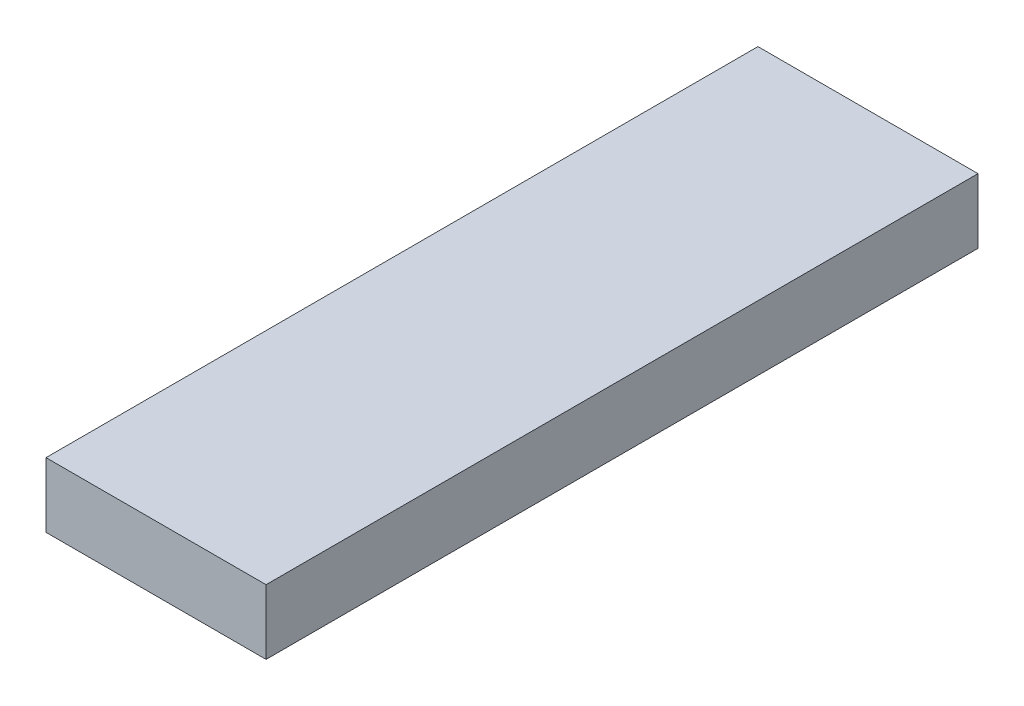
ISO-10303-21;
HEADER;
FILE_DESCRIPTION(('STEP AP214'),'2;1');
FILE_NAME('part.step','',(''),(''),'','','');
FILE_SCHEMA(('AUTOMOTIVE_DESIGN { 1 0 10303 214 1 1 1 1 }'));
ENDSEC;
DATA;
#1=APPLICATION_CONTEXT('core data for automotive mechanical design processes');
#2=APPLICATION_PROTOCOL_DEFINITION('international standard','automotive_design',2000,#1);
#3=PRODUCT_CONTEXT('',#1,'mechanical');
#4=PRODUCT('Part','Part','',(#3));
#5=PRODUCT_RELATED_PRODUCT_CATEGORY('part','',(#4));
#6=PRODUCT_DEFINITION_FORMATION('','',#4);
#7=PRODUCT_DEFINITION_CONTEXT('part definition',#1,'design');
#8=PRODUCT_DEFINITION('design','',#6,#7);
#9=PRODUCT_DEFINITION_SHAPE('','',#8);
#10=(LENGTH_UNIT() NAMED_UNIT(*) SI_UNIT(.MILLI.,.METRE.));
#11=(NAMED_UNIT(*) PLANE_ANGLE_UNIT() SI_UNIT($,.RADIAN.));
#12=(NAMED_UNIT(*) SI_UNIT($,.STERADIAN.) SOLID_ANGLE_UNIT());
#13=UNCERTAINTY_MEASURE_WITH_UNIT(LENGTH_MEASURE(1.E-05),#10,'distance_accuracy_value','');
#14=(GEOMETRIC_REPRESENTATION_CONTEXT(3) GLOBAL_UNCERTAINTY_ASSIGNED_CONTEXT((#13)) GLOBAL_UNIT_ASSIGNED_CONTEXT((#10,
#11,#12)) REPRESENTATION_CONTEXT('',''));
#15=CARTESIAN_POINT('',(0.,0.,0.));
#16=DIRECTION('',(0.,0.,1.));
#17=DIRECTION('',(1.,0.,0.));
#18=AXIS2_PLACEMENT_3D('',#15,#16,#17);
#19=CARTESIAN_POINT('',(-4.6,10.,-4.43262956981357));
#20=DIRECTION('',(1.,0.,0.));
#21=DIRECTION('',(0.,0.,-1.));
#22=AXIS2_PLACEMENT_3D('',#19,#20,#21);
#23=PLANE('',#22);
#24=DIRECTION('',(0.,0.,1.));
#25=VECTOR('',#24,1.);
#26=CARTESIAN_POINT('',(-4.6,0.,-4.43262956981357));
#27=LINE('',#26,#25);
#28=CARTESIAN_POINT('',(-4.6,0.,-4.43262956981357));
#29=VERTEX_POINT('',#28);
#30=CARTESIAN_POINT('',(-4.6,0.,105.567370430186));
#31=VERTEX_POINT('',#30);
#32=EDGE_CURVE('E86',#29,#31,#27,.T.);
#33=ORIENTED_EDGE('',*,*,#32,.T.);
#34=DIRECTION('',(0.,-1.,0.));
#35=VECTOR('',#34,1.);
#36=CARTESIAN_POINT('',(-4.6,10.,105.567370430186));
#37=LINE('',#36,#35);
#38=CARTESIAN_POINT('',(-4.6,10.,105.567370430186));
#39=VERTEX_POINT('',#38);
#40=EDGE_CURVE('E89',#39,#31,#37,.T.);
#41=ORIENTED_EDGE('',*,*,#40,.F.);
#42=DIRECTION('',(0.,0.,1.));
#43=VECTOR('',#42,1.);
#44=CARTESIAN_POINT('',(-4.6,10.,-4.43262956981357));
#45=LINE('',#44,#43);
#46=CARTESIAN_POINT('',(-4.6,10.,-4.43262956981357));
#47=VERTEX_POINT('',#46);
#48=EDGE_CURVE('E74',#47,#39,#45,.T.);
#49=ORIENTED_EDGE('',*,*,#48,.F.);
#50=DIRECTION('',(0.,-1.,0.));
#51=VECTOR('',#50,1.);
#52=CARTESIAN_POINT('',(-4.6,10.,-4.43262956981357));
#53=LINE('',#52,#51);
#54=EDGE_CURVE('E49',#47,#29,#53,.T.);
#55=ORIENTED_EDGE('',*,*,#54,.T.);
#56=EDGE_LOOP('',(#33,#41,#49,#55));
#57=FACE_BOUND('',#56,.T.);
#58=ADVANCED_FACE('F41',(#57),#23,.F.);
#59=CARTESIAN_POINT('',(29.4,10.,-4.43262956981357));
#60=DIRECTION('',(-1.,0.,0.));
#61=DIRECTION('',(0.,0.,1.));
#62=AXIS2_PLACEMENT_3D('',#59,#60,#61);
#63=PLANE('',#62);
#64=DIRECTION('',(0.,0.,-1.));
#65=VECTOR('',#64,1.);
#66=CARTESIAN_POINT('',(29.4,0.,-4.43262956981357));
#67=LINE('',#66,#65);
#68=CARTESIAN_POINT('',(29.4,0.,105.567370430186));
#69=VERTEX_POINT('',#68);
#70=CARTESIAN_POINT('',(29.4,0.,-4.43262956981357));
#71=VERTEX_POINT('',#70);
#72=EDGE_CURVE('E68',#69,#71,#67,.T.);
#73=ORIENTED_EDGE('',*,*,#72,.T.);
#74=DIRECTION('',(0.,-1.,0.));
#75=VECTOR('',#74,1.);
#76=CARTESIAN_POINT('',(29.4,10.,-4.43262956981357));
#77=LINE('',#76,#75);
#78=CARTESIAN_POINT('',(29.4,10.,-4.43262956981357));
#79=VERTEX_POINT('',#78);
#80=EDGE_CURVE('E11',#79,#71,#77,.T.);
#81=ORIENTED_EDGE('',*,*,#80,.F.);
#82=DIRECTION('',(0.,0.,-1.));
#83=VECTOR('',#82,1.);
#84=CARTESIAN_POINT('',(29.4,10.,-4.43262956981357));
#85=LINE('',#84,#83);
#86=CARTESIAN_POINT('',(29.4,10.,105.567370430186));
#87=VERTEX_POINT('',#86);
#88=EDGE_CURVE('E133',#87,#79,#85,.T.);
#89=ORIENTED_EDGE('',*,*,#88,.F.);
#90=DIRECTION('',(0.,-1.,0.));
#91=VECTOR('',#90,1.);
#92=CARTESIAN_POINT('',(29.4,10.,105.567370430186));
#93=LINE('',#92,#91);
#94=EDGE_CURVE('E104',#87,#69,#93,.T.);
#95=ORIENTED_EDGE('',*,*,#94,.T.);
#96=EDGE_LOOP('',(#73,#81,#89,#95));
#97=FACE_BOUND('',#96,.T.);
#98=ADVANCED_FACE('F140',(#97),#63,.F.);
#99=CARTESIAN_POINT('',(-4.6,10.,-4.43262956981357));
#100=DIRECTION('',(0.,0.,1.));
#101=DIRECTION('',(1.,0.,0.));
#102=AXIS2_PLACEMENT_3D('',#99,#100,#101);
#103=PLANE('',#102);
#104=DIRECTION('',(-1.,0.,0.));
#105=VECTOR('',#104,1.);
#106=CARTESIAN_POINT('',(-4.6,0.,-4.43262956981357));
#107=LINE('',#106,#105);
#108=EDGE_CURVE('E134',#71,#29,#107,.T.);
#109=ORIENTED_EDGE('',*,*,#108,.T.);
#110=ORIENTED_EDGE('',*,*,#54,.F.);
#111=DIRECTION('',(-1.,0.,0.));
#112=VECTOR('',#111,1.);
#113=CARTESIAN_POINT('',(-4.6,10.,-4.43262956981357));
#114=LINE('',#113,#112);
#115=EDGE_CURVE('E57',#79,#47,#114,.T.);
#116=ORIENTED_EDGE('',*,*,#115,.F.);
#117=ORIENTED_EDGE('',*,*,#80,.T.);
#118=EDGE_LOOP('',(#109,#110,#116,#117));
#119=FACE_BOUND('',#118,.T.);
#120=ADVANCED_FACE('F139',(#119),#103,.F.);
#121=CARTESIAN_POINT('',(0.,10.,0.));
#122=DIRECTION('',(0.,1.,0.));
#123=DIRECTION('',(0.,0.,1.));
#124=AXIS2_PLACEMENT_3D('',#121,#122,#123);
#125=PLANE('',#124);
#126=ORIENTED_EDGE('',*,*,#48,.T.);
#127=DIRECTION('',(-1.,0.,0.));
#128=VECTOR('',#127,1.);
#129=CARTESIAN_POINT('',(-4.6,10.,105.567370430186));
#130=LINE('',#129,#128);
#131=EDGE_CURVE('E100',#87,#39,#130,.T.);
#132=ORIENTED_EDGE('',*,*,#131,.F.);
#133=ORIENTED_EDGE('',*,*,#88,.T.);
#134=ORIENTED_EDGE('',*,*,#115,.T.);
#135=EDGE_LOOP('',(#126,#132,#133,#134));
#136=FACE_BOUND('',#135,.T.);
#137=ADVANCED_FACE('F141',(#136),#125,.T.);
#138=CARTESIAN_POINT('',(0.,0.,0.));
#139=DIRECTION('',(0.,1.,0.));
#140=DIRECTION('',(0.,0.,1.));
#141=AXIS2_PLACEMENT_3D('',#138,#139,#140);
#142=PLANE('',#141);
#143=CARTESIAN_POINT('',(24.8,0.,0.));
#144=DIRECTION('',(0.,1.,0.));
#145=DIRECTION('',(0.,0.,1.));
#146=AXIS2_PLACEMENT_3D('',#143,#144,#145);
#147=CIRCLE('',#146,3.15);
#148=CARTESIAN_POINT('',(24.8,0.,3.15));
#149=VERTEX_POINT('',#148);
#150=EDGE_CURVE('E116',#149,#149,#147,.T.);
#151=ORIENTED_EDGE('',*,*,#150,.T.);
#152=EDGE_LOOP('',(#151));
#153=FACE_BOUND('',#152,.T.);
#154=CARTESIAN_POINT('',(2.58247649578986E-13,0.,24.8));
#155=DIRECTION('',(0.,1.,0.));
#156=DIRECTION('',(0.,0.,1.));
#157=AXIS2_PLACEMENT_3D('',#154,#155,#156);
#158=CIRCLE('',#157,3.15);
#159=CARTESIAN_POINT('',(2.58247649578986E-13,0.,27.95));
#160=VERTEX_POINT('',#159);
#161=EDGE_CURVE('E123',#160,#160,#158,.T.);
#162=ORIENTED_EDGE('',*,*,#161,.T.);
#163=EDGE_LOOP('',(#162));
#164=FACE_BOUND('',#163,.T.);
#165=CARTESIAN_POINT('',(24.8000000000003,0.,24.8));
#166=DIRECTION('',(0.,1.,0.));
#167=DIRECTION('',(0.,0.,1.));
#168=AXIS2_PLACEMENT_3D('',#165,#166,#167);
#169=CIRCLE('',#168,3.15);
#170=CARTESIAN_POINT('',(24.8000000000003,0.,27.95));
#171=VERTEX_POINT('',#170);
#172=EDGE_CURVE('E110',#171,#171,#169,.T.);
#173=ORIENTED_EDGE('',*,*,#172,.T.);
#174=EDGE_LOOP('',(#173));
#175=FACE_BOUND('',#174,.T.);
#176=CARTESIAN_POINT('',(0.,0.,0.));
#177=DIRECTION('',(0.,1.,0.));
#178=DIRECTION('',(0.,0.,1.));
#179=AXIS2_PLACEMENT_3D('',#176,#177,#178);
#180=CIRCLE('',#179,3.15);
#181=CARTESIAN_POINT('',(0.,0.,3.15));
#182=VERTEX_POINT('',#181);
#183=EDGE_CURVE('E119',#182,#182,#180,.T.);
#184=ORIENTED_EDGE('',*,*,#183,.T.);
#185=EDGE_LOOP('',(#184));
#186=FACE_BOUND('',#185,.T.);
#187=ORIENTED_EDGE('',*,*,#32,.F.);
#188=ORIENTED_EDGE('',*,*,#108,.F.);
#189=ORIENTED_EDGE('',*,*,#72,.F.);
#190=DIRECTION('',(-1.,0.,0.));
#191=VECTOR('',#190,1.);
#192=CARTESIAN_POINT('',(-4.6,0.,105.567370430186));
#193=LINE('',#192,#191);
#194=EDGE_CURVE('E95',#69,#31,#193,.T.);
#195=ORIENTED_EDGE('',*,*,#194,.T.);
#196=EDGE_LOOP('',(#187,#188,#189,#195));
#197=FACE_BOUND('',#196,.T.);
#198=CARTESIAN_POINT('',(24.8,0.,101.134740860373));
#199=DIRECTION('',(0.,-1.,0.));
#200=DIRECTION('',(0.,0.,-1.));
#201=AXIS2_PLACEMENT_3D('',#198,#199,#200);
#202=CIRCLE('',#201,3.15);
#203=CARTESIAN_POINT('',(24.8,0.,97.9847408603729));
#204=VERTEX_POINT('',#203);
#205=EDGE_CURVE('E379',#204,#204,#202,.T.);
#206=ORIENTED_EDGE('',*,*,#205,.F.);
#207=EDGE_LOOP('',(#206));
#208=FACE_BOUND('',#207,.T.);
#209=CARTESIAN_POINT('',(2.58247649578986E-13,0.,76.3347408603729));
#210=DIRECTION('',(0.,-1.,0.));
#211=DIRECTION('',(0.,0.,-1.));
#212=AXIS2_PLACEMENT_3D('',#209,#210,#211);
#213=CIRCLE('',#212,3.15);
#214=CARTESIAN_POINT('',(2.58247649578986E-13,0.,73.1847408603729));
#215=VERTEX_POINT('',#214);
#216=EDGE_CURVE('E380',#215,#215,#213,.T.);
#217=ORIENTED_EDGE('',*,*,#216,.F.);
#218=EDGE_LOOP('',(#217));
#219=FACE_BOUND('',#218,.T.);
#220=CARTESIAN_POINT('',(24.8000000000003,0.,76.3347408603729));
#221=DIRECTION('',(0.,-1.,0.));
#222=DIRECTION('',(0.,0.,-1.));
#223=AXIS2_PLACEMENT_3D('',#220,#221,#222);
#224=CIRCLE('',#223,3.15);
#225=CARTESIAN_POINT('',(24.8000000000003,0.,73.1847408603729));
#226=VERTEX_POINT('',#225);
#227=EDGE_CURVE('E392',#226,#226,#224,.T.);
#228=ORIENTED_EDGE('',*,*,#227,.F.);
#229=EDGE_LOOP('',(#228));
#230=FACE_BOUND('',#229,.T.);
#231=CARTESIAN_POINT('',(0.,0.,101.134740860373));
#232=DIRECTION('',(0.,-1.,0.));
#233=DIRECTION('',(0.,0.,-1.));
#234=AXIS2_PLACEMENT_3D('',#231,#232,#233);
#235=CIRCLE('',#234,3.15);
#236=CARTESIAN_POINT('',(0.,0.,97.9847408603729));
#237=VERTEX_POINT('',#236);
#238=EDGE_CURVE('E383',#237,#237,#235,.T.);
#239=ORIENTED_EDGE('',*,*,#238,.F.);
#240=EDGE_LOOP('',(#239));
#241=FACE_BOUND('',#240,.T.);
#242=ADVANCED_FACE('F96',(#153,#164,#175,#186,#197,#208,#219,#230,#241),#142,.F.);
#243=CARTESIAN_POINT('',(0.,5.,0.));
#244=DIRECTION('',(0.,-1.,0.));
#245=DIRECTION('',(0.,0.,-1.));
#246=AXIS2_PLACEMENT_3D('',#243,#244,#245);
#247=CYLINDRICAL_SURFACE('',#246,3.15);
#248=CARTESIAN_POINT('',(0.,5.,0.));
#249=DIRECTION('',(0.,1.,0.));
#250=DIRECTION('',(0.,0.,1.));
#251=AXIS2_PLACEMENT_3D('',#248,#249,#250);
#252=CIRCLE('',#251,3.15);
#253=CARTESIAN_POINT('',(0.,5.,3.15));
#254=VERTEX_POINT('',#253);
#255=EDGE_CURVE('E92',#254,#254,#252,.T.);
#256=ORIENTED_EDGE('',*,*,#255,.T.);
#257=EDGE_LOOP('',(#256));
#258=FACE_BOUND('',#257,.T.);
#259=ORIENTED_EDGE('',*,*,#183,.F.);
#260=EDGE_LOOP('',(#259));
#261=FACE_BOUND('',#260,.T.);
#262=ADVANCED_FACE('F148',(#258,#261),#247,.F.);
#263=CARTESIAN_POINT('',(0.,5.,0.));
#264=DIRECTION('',(0.,1.,0.));
#265=DIRECTION('',(0.,0.,1.));
#266=AXIS2_PLACEMENT_3D('',#263,#264,#265);
#267=PLANE('',#266);
#268=ORIENTED_EDGE('',*,*,#255,.F.);
#269=EDGE_LOOP('',(#268));
#270=FACE_BOUND('',#269,.T.);
#271=ADVANCED_FACE('F278',(#270),#267,.F.);
#272=CARTESIAN_POINT('',(24.8000000000003,5.,24.8));
#273=DIRECTION('',(0.,-1.,0.));
#274=DIRECTION('',(0.,0.,-1.));
#275=AXIS2_PLACEMENT_3D('',#272,#273,#274);
#276=CYLINDRICAL_SURFACE('',#275,3.15);
#277=CARTESIAN_POINT('',(24.8000000000003,5.,24.8));
#278=DIRECTION('',(0.,1.,0.));
#279=DIRECTION('',(0.,0.,1.));
#280=AXIS2_PLACEMENT_3D('',#277,#278,#279);
#281=CIRCLE('',#280,3.15);
#282=CARTESIAN_POINT('',(24.8000000000003,5.,27.95));
#283=VERTEX_POINT('',#282);
#284=EDGE_CURVE('E106',#283,#283,#281,.T.);
#285=ORIENTED_EDGE('',*,*,#284,.T.);
#286=EDGE_LOOP('',(#285));
#287=FACE_BOUND('',#286,.T.);
#288=ORIENTED_EDGE('',*,*,#172,.F.);
#289=EDGE_LOOP('',(#288));
#290=FACE_BOUND('',#289,.T.);
#291=ADVANCED_FACE('F274',(#287,#290),#276,.F.);
#292=CARTESIAN_POINT('',(24.8000000000003,5.,24.8));
#293=DIRECTION('',(0.,1.,0.));
#294=DIRECTION('',(0.,0.,1.));
#295=AXIS2_PLACEMENT_3D('',#292,#293,#294);
#296=PLANE('',#295);
#297=ORIENTED_EDGE('',*,*,#284,.F.);
#298=EDGE_LOOP('',(#297));
#299=FACE_BOUND('',#298,.T.);
#300=ADVANCED_FACE('F277',(#299),#296,.F.);
#301=CARTESIAN_POINT('',(2.58247649578986E-13,5.,24.8));
#302=DIRECTION('',(0.,-1.,0.));
#303=DIRECTION('',(0.,0.,-1.));
#304=AXIS2_PLACEMENT_3D('',#301,#302,#303);
#305=CYLINDRICAL_SURFACE('',#304,3.15);
#306=CARTESIAN_POINT('',(2.58247649578986E-13,5.,24.8));
#307=DIRECTION('',(0.,1.,0.));
#308=DIRECTION('',(0.,0.,1.));
#309=AXIS2_PLACEMENT_3D('',#306,#307,#308);
#310=CIRCLE('',#309,3.15);
#311=CARTESIAN_POINT('',(2.58247649578986E-13,5.,27.95));
#312=VERTEX_POINT('',#311);
#313=EDGE_CURVE('E113',#312,#312,#310,.T.);
#314=ORIENTED_EDGE('',*,*,#313,.T.);
#315=EDGE_LOOP('',(#314));
#316=FACE_BOUND('',#315,.T.);
#317=ORIENTED_EDGE('',*,*,#161,.F.);
#318=EDGE_LOOP('',(#317));
#319=FACE_BOUND('',#318,.T.);
#320=ADVANCED_FACE('F282',(#316,#319),#305,.F.);
#321=CARTESIAN_POINT('',(2.58247649578986E-13,5.,24.8));
#322=DIRECTION('',(0.,1.,0.));
#323=DIRECTION('',(0.,0.,1.));
#324=AXIS2_PLACEMENT_3D('',#321,#322,#323);
#325=PLANE('',#324);
#326=ORIENTED_EDGE('',*,*,#313,.F.);
#327=EDGE_LOOP('',(#326));
#328=FACE_BOUND('',#327,.T.);
#329=ADVANCED_FACE('F286',(#328),#325,.F.);
#330=CARTESIAN_POINT('',(24.8,5.,0.));
#331=DIRECTION('',(0.,-1.,0.));
#332=DIRECTION('',(0.,0.,-1.));
#333=AXIS2_PLACEMENT_3D('',#330,#331,#332);
#334=CYLINDRICAL_SURFACE('',#333,3.15);
#335=CARTESIAN_POINT('',(24.8,5.,0.));
#336=DIRECTION('',(0.,1.,0.));
#337=DIRECTION('',(0.,0.,1.));
#338=AXIS2_PLACEMENT_3D('',#335,#336,#337);
#339=CIRCLE('',#338,3.15);
#340=CARTESIAN_POINT('',(24.8,5.,3.15));
#341=VERTEX_POINT('',#340);
#342=EDGE_CURVE('E120',#341,#341,#339,.T.);
#343=ORIENTED_EDGE('',*,*,#342,.T.);
#344=EDGE_LOOP('',(#343));
#345=FACE_BOUND('',#344,.T.);
#346=ORIENTED_EDGE('',*,*,#150,.F.);
#347=EDGE_LOOP('',(#346));
#348=FACE_BOUND('',#347,.T.);
#349=ADVANCED_FACE('F284',(#345,#348),#334,.F.);
#350=CARTESIAN_POINT('',(24.8,5.,0.));
#351=DIRECTION('',(0.,1.,0.));
#352=DIRECTION('',(0.,0.,1.));
#353=AXIS2_PLACEMENT_3D('',#350,#351,#352);
#354=PLANE('',#353);
#355=ORIENTED_EDGE('',*,*,#342,.F.);
#356=EDGE_LOOP('',(#355));
#357=FACE_BOUND('',#356,.T.);
#358=ADVANCED_FACE('F189',(#357),#354,.F.);
#359=CARTESIAN_POINT('',(-4.6,10.,105.567370430186));
#360=DIRECTION('',(0.,0.,-1.));
#361=DIRECTION('',(1.,0.,0.));
#362=AXIS2_PLACEMENT_3D('',#359,#360,#361);
#363=PLANE('',#362);
#364=ORIENTED_EDGE('',*,*,#194,.F.);
#365=ORIENTED_EDGE('',*,*,#94,.F.);
#366=ORIENTED_EDGE('',*,*,#131,.T.);
#367=ORIENTED_EDGE('',*,*,#40,.T.);
#368=EDGE_LOOP('',(#364,#365,#366,#367));
#369=FACE_BOUND('',#368,.T.);
#370=ADVANCED_FACE('F103',(#369),#363,.F.);
#371=CARTESIAN_POINT('',(0.,5.,101.134740860373));
#372=DIRECTION('',(0.,-1.,0.));
#373=DIRECTION('',(0.,0.,1.));
#374=AXIS2_PLACEMENT_3D('',#371,#372,#373);
#375=CYLINDRICAL_SURFACE('',#374,3.15);
#376=CARTESIAN_POINT('',(0.,5.,101.134740860373));
#377=DIRECTION('',(0.,-1.,0.));
#378=DIRECTION('',(0.,0.,-1.));
#379=AXIS2_PLACEMENT_3D('',#376,#377,#378);
#380=CIRCLE('',#379,3.15);
#381=CARTESIAN_POINT('',(0.,5.,97.9847408603729));
#382=VERTEX_POINT('',#381);
#383=EDGE_CURVE('E101',#382,#382,#380,.T.);
#384=ORIENTED_EDGE('',*,*,#383,.F.);
#385=EDGE_LOOP('',(#384));
#386=FACE_BOUND('',#385,.T.);
#387=ORIENTED_EDGE('',*,*,#238,.T.);
#388=EDGE_LOOP('',(#387));
#389=FACE_BOUND('',#388,.T.);
#390=ADVANCED_FACE('F188',(#386,#389),#375,.F.);
#391=CARTESIAN_POINT('',(0.,5.,101.134740860373));
#392=DIRECTION('',(0.,1.,0.));
#393=DIRECTION('',(0.,0.,-1.));
#394=AXIS2_PLACEMENT_3D('',#391,#392,#393);
#395=PLANE('',#394);
#396=ORIENTED_EDGE('',*,*,#383,.T.);
#397=EDGE_LOOP('',(#396));
#398=FACE_BOUND('',#397,.T.);
#399=ADVANCED_FACE('F199',(#398),#395,.F.);
#400=CARTESIAN_POINT('',(24.8000000000003,5.,76.3347408603729));
#401=DIRECTION('',(0.,-1.,0.));
#402=DIRECTION('',(0.,0.,1.));
#403=AXIS2_PLACEMENT_3D('',#400,#401,#402);
#404=CYLINDRICAL_SURFACE('',#403,3.15);
#405=CARTESIAN_POINT('',(24.8000000000003,5.,76.3347408603729));
#406=DIRECTION('',(0.,-1.,0.));
#407=DIRECTION('',(0.,0.,-1.));
#408=AXIS2_PLACEMENT_3D('',#405,#406,#407);
#409=CIRCLE('',#408,3.15);
#410=CARTESIAN_POINT('',(24.8000000000003,5.,73.1847408603729));
#411=VERTEX_POINT('',#410);
#412=EDGE_CURVE('E402',#411,#411,#409,.T.);
#413=ORIENTED_EDGE('',*,*,#412,.F.);
#414=EDGE_LOOP('',(#413));
#415=FACE_BOUND('',#414,.T.);
#416=ORIENTED_EDGE('',*,*,#227,.T.);
#417=EDGE_LOOP('',(#416));
#418=FACE_BOUND('',#417,.T.);
#419=ADVANCED_FACE('F209',(#415,#418),#404,.F.);
#420=CARTESIAN_POINT('',(24.8000000000003,5.,76.3347408603729));
#421=DIRECTION('',(0.,1.,0.));
#422=DIRECTION('',(0.,0.,-1.));
#423=AXIS2_PLACEMENT_3D('',#420,#421,#422);
#424=PLANE('',#423);
#425=ORIENTED_EDGE('',*,*,#412,.T.);
#426=EDGE_LOOP('',(#425));
#427=FACE_BOUND('',#426,.T.);
#428=ADVANCED_FACE('F219',(#427),#424,.F.);
#429=CARTESIAN_POINT('',(2.58247649578986E-13,5.,76.3347408603729));
#430=DIRECTION('',(0.,-1.,0.));
#431=DIRECTION('',(0.,0.,1.));
#432=AXIS2_PLACEMENT_3D('',#429,#430,#431);
#433=CYLINDRICAL_SURFACE('',#432,3.15);
#434=CARTESIAN_POINT('',(2.58247649578986E-13,5.,76.3347408603729));
#435=DIRECTION('',(0.,-1.,0.));
#436=DIRECTION('',(0.,0.,-1.));
#437=AXIS2_PLACEMENT_3D('',#434,#435,#436);
#438=CIRCLE('',#437,3.15);
#439=CARTESIAN_POINT('',(2.58247649578986E-13,5.,73.1847408603729));
#440=VERTEX_POINT('',#439);
#441=EDGE_CURVE('E386',#440,#440,#438,.T.);
#442=ORIENTED_EDGE('',*,*,#441,.F.);
#443=EDGE_LOOP('',(#442));
#444=FACE_BOUND('',#443,.T.);
#445=ORIENTED_EDGE('',*,*,#216,.T.);
#446=EDGE_LOOP('',(#445));
#447=FACE_BOUND('',#446,.T.);
#448=ADVANCED_FACE('F229',(#444,#447),#433,.F.);
#449=CARTESIAN_POINT('',(2.58247649578986E-13,5.,76.3347408603729));
#450=DIRECTION('',(0.,1.,0.));
#451=DIRECTION('',(0.,0.,-1.));
#452=AXIS2_PLACEMENT_3D('',#449,#450,#451);
#453=PLANE('',#452);
#454=ORIENTED_EDGE('',*,*,#441,.T.);
#455=EDGE_LOOP('',(#454));
#456=FACE_BOUND('',#455,.T.);
#457=ADVANCED_FACE('F239',(#456),#453,.F.);
#458=CARTESIAN_POINT('',(24.8,5.,101.134740860373));
#459=DIRECTION('',(0.,-1.,0.));
#460=DIRECTION('',(0.,0.,1.));
#461=AXIS2_PLACEMENT_3D('',#458,#459,#460);
#462=CYLINDRICAL_SURFACE('',#461,3.15);
#463=CARTESIAN_POINT('',(24.8,5.,101.134740860373));
#464=DIRECTION('',(0.,-1.,0.));
#465=DIRECTION('',(0.,0.,-1.));
#466=AXIS2_PLACEMENT_3D('',#463,#464,#465);
#467=CIRCLE('',#466,3.15);
#468=CARTESIAN_POINT('',(24.8,5.,97.9847408603729));
#469=VERTEX_POINT('',#468);
#470=EDGE_CURVE('E378',#469,#469,#467,.T.);
#471=ORIENTED_EDGE('',*,*,#470,.F.);
#472=EDGE_LOOP('',(#471));
#473=FACE_BOUND('',#472,.T.);
#474=ORIENTED_EDGE('',*,*,#205,.T.);
#475=EDGE_LOOP('',(#474));
#476=FACE_BOUND('',#475,.T.);
#477=ADVANCED_FACE('F249',(#473,#476),#462,.F.);
#478=CARTESIAN_POINT('',(24.8,5.,101.134740860373));
#479=DIRECTION('',(0.,1.,0.));
#480=DIRECTION('',(0.,0.,-1.));
#481=AXIS2_PLACEMENT_3D('',#478,#479,#480);
#482=PLANE('',#481);
#483=ORIENTED_EDGE('',*,*,#470,.T.);
#484=EDGE_LOOP('',(#483));
#485=FACE_BOUND('',#484,.T.);
#486=ADVANCED_FACE('F259',(#485),#482,.F.);
#487=CLOSED_SHELL('',(#58,#98,#120,#137,#242,#262,#271,#291,#300,#320,#329,#349,#358,#370,#390,
#399,#419,#428,#448,#457,#477,#486));
#488=MANIFOLD_SOLID_BREP('B2',#487);
#489=ADVANCED_BREP_SHAPE_REPRESENTATION('',(#18,#488),#14);
#490=SHAPE_DEFINITION_REPRESENTATION(#9,#489);
ENDSEC;
END-ISO-10303-21;
